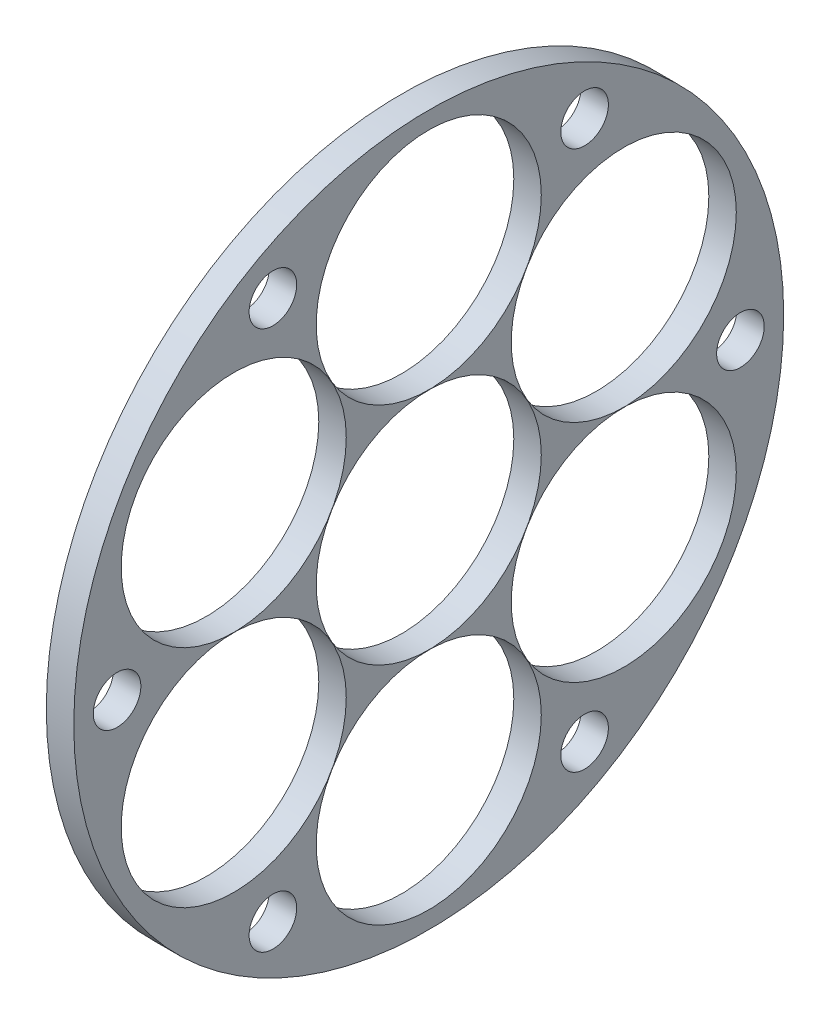
ISO-10303-21;
HEADER;
FILE_DESCRIPTION(('STEP AP214'),'2;1');
FILE_NAME('part.step','',(''),(''),'','','');
FILE_SCHEMA(('AUTOMOTIVE_DESIGN { 1 0 10303 214 1 1 1 1 }'));
ENDSEC;
DATA;
#1=APPLICATION_CONTEXT('core data for automotive mechanical design processes');
#2=APPLICATION_PROTOCOL_DEFINITION('international standard','automotive_design',2000,#1);
#3=PRODUCT_CONTEXT('',#1,'mechanical');
#4=PRODUCT('Part','Part','',(#3));
#5=PRODUCT_RELATED_PRODUCT_CATEGORY('part','',(#4));
#6=PRODUCT_DEFINITION_FORMATION('','',#4);
#7=PRODUCT_DEFINITION_CONTEXT('part definition',#1,'design');
#8=PRODUCT_DEFINITION('design','',#6,#7);
#9=PRODUCT_DEFINITION_SHAPE('','',#8);
#10=(LENGTH_UNIT() NAMED_UNIT(*) SI_UNIT(.MILLI.,.METRE.));
#11=(NAMED_UNIT(*) PLANE_ANGLE_UNIT() SI_UNIT($,.RADIAN.));
#12=(NAMED_UNIT(*) SI_UNIT($,.STERADIAN.) SOLID_ANGLE_UNIT());
#13=UNCERTAINTY_MEASURE_WITH_UNIT(LENGTH_MEASURE(1.E-05),#10,'distance_accuracy_value','');
#14=(GEOMETRIC_REPRESENTATION_CONTEXT(3) GLOBAL_UNCERTAINTY_ASSIGNED_CONTEXT((#13)) GLOBAL_UNIT_ASSIGNED_CONTEXT((#10,
#11,#12)) REPRESENTATION_CONTEXT('',''));
#15=CARTESIAN_POINT('',(0.,0.,0.));
#16=DIRECTION('',(0.,0.,1.));
#17=DIRECTION('',(1.,0.,0.));
#18=AXIS2_PLACEMENT_3D('',#15,#16,#17);
#19=CARTESIAN_POINT('',(3.175,0.,0.));
#20=DIRECTION('',(-1.,0.,0.));
#21=DIRECTION('',(0.,0.,1.));
#22=AXIS2_PLACEMENT_3D('',#19,#20,#21);
#23=CYLINDRICAL_SURFACE('',#22,41.);
#24=CARTESIAN_POINT('',(3.175,0.,0.));
#25=DIRECTION('',(1.,0.,0.));
#26=DIRECTION('',(0.,0.,-1.));
#27=AXIS2_PLACEMENT_3D('',#24,#25,#26);
#28=CIRCLE('',#27,41.);
#29=CARTESIAN_POINT('',(3.175,0.,-41.));
#30=VERTEX_POINT('',#29);
#31=EDGE_CURVE('E10',#30,#30,#28,.T.);
#32=ORIENTED_EDGE('',*,*,#31,.F.);
#33=EDGE_LOOP('',(#32));
#34=FACE_BOUND('',#33,.T.);
#35=CARTESIAN_POINT('',(0.,0.,0.));
#36=DIRECTION('',(1.,0.,0.));
#37=DIRECTION('',(0.,0.,-1.));
#38=AXIS2_PLACEMENT_3D('',#35,#36,#37);
#39=CIRCLE('',#38,41.);
#40=CARTESIAN_POINT('',(0.,0.,-41.));
#41=VERTEX_POINT('',#40);
#42=EDGE_CURVE('E38',#41,#41,#39,.T.);
#43=ORIENTED_EDGE('',*,*,#42,.T.);
#44=EDGE_LOOP('',(#43));
#45=FACE_BOUND('',#44,.T.);
#46=ADVANCED_FACE('F31',(#34,#45),#23,.T.);
#47=CARTESIAN_POINT('',(3.175,0.,0.));
#48=DIRECTION('',(1.,0.,0.));
#49=DIRECTION('',(0.,0.,-1.));
#50=AXIS2_PLACEMENT_3D('',#47,#48,#49);
#51=PLANE('',#50);
#52=CARTESIAN_POINT('',(3.175,-9.55835507043893E-13,35.999999999998));
#53=DIRECTION('',(1.,0.,0.));
#54=DIRECTION('',(0.,0.,-1.));
#55=AXIS2_PLACEMENT_3D('',#52,#53,#54);
#56=CIRCLE('',#55,2.74999999999999);
#57=CARTESIAN_POINT('',(3.175,-9.55835507043893E-13,33.249999999998));
#58=VERTEX_POINT('',#57);
#59=EDGE_CURVE('E102',#58,#58,#56,.T.);
#60=ORIENTED_EDGE('',*,*,#59,.F.);
#61=EDGE_LOOP('',(#60));
#62=FACE_BOUND('',#61,.T.);
#63=CARTESIAN_POINT('',(3.175,-31.1769145362397,17.9999999999962));
#64=DIRECTION('',(1.,0.,0.));
#65=DIRECTION('',(0.,0.,-1.));
#66=AXIS2_PLACEMENT_3D('',#63,#64,#65);
#67=CIRCLE('',#66,2.75);
#68=CARTESIAN_POINT('',(3.175,-31.1769145362397,15.2499999999963));
#69=VERTEX_POINT('',#68);
#70=EDGE_CURVE('E92',#69,#69,#67,.T.);
#71=ORIENTED_EDGE('',*,*,#70,.F.);
#72=EDGE_LOOP('',(#71));
#73=FACE_BOUND('',#72,.T.);
#74=CARTESIAN_POINT('',(3.175,-31.1769145362376,-18.0000000000037));
#75=DIRECTION('',(1.,0.,0.));
#76=DIRECTION('',(0.,0.,-1.));
#77=AXIS2_PLACEMENT_3D('',#74,#75,#76);
#78=CIRCLE('',#77,2.75);
#79=CARTESIAN_POINT('',(3.175,-31.1769145362376,-20.7500000000037));
#80=VERTEX_POINT('',#79);
#81=EDGE_CURVE('E89',#80,#80,#78,.T.);
#82=ORIENTED_EDGE('',*,*,#81,.F.);
#83=EDGE_LOOP('',(#82));
#84=FACE_BOUND('',#83,.T.);
#85=CARTESIAN_POINT('',(3.175,3.18322045019811E-12,-36.000000000002));
#86=DIRECTION('',(1.,0.,0.));
#87=DIRECTION('',(0.,0.,-1.));
#88=AXIS2_PLACEMENT_3D('',#85,#86,#87);
#89=CIRCLE('',#88,2.75);
#90=CARTESIAN_POINT('',(3.175,3.18322045019811E-12,-38.750000000002));
#91=VERTEX_POINT('',#90);
#92=EDGE_CURVE('E86',#91,#91,#89,.T.);
#93=ORIENTED_EDGE('',*,*,#92,.F.);
#94=EDGE_LOOP('',(#93));
#95=FACE_BOUND('',#94,.T.);
#96=CARTESIAN_POINT('',(3.175,31.1769145362419,-18.0000000000002));
#97=DIRECTION('',(1.,0.,0.));
#98=DIRECTION('',(0.,0.,-1.));
#99=AXIS2_PLACEMENT_3D('',#96,#97,#98);
#100=CIRCLE('',#99,2.75);
#101=CARTESIAN_POINT('',(3.175,31.1769145362419,-20.7500000000002));
#102=VERTEX_POINT('',#101);
#103=EDGE_CURVE('E82',#102,#102,#100,.T.);
#104=ORIENTED_EDGE('',*,*,#103,.F.);
#105=EDGE_LOOP('',(#104));
#106=FACE_BOUND('',#105,.T.);
#107=CARTESIAN_POINT('',(3.175,13.0049999999981,22.5253207524322));
#108=DIRECTION('',(1.,0.,0.));
#109=DIRECTION('',(0.,0.,-1.));
#110=AXIS2_PLACEMENT_3D('',#107,#108,#109);
#111=CIRCLE('',#110,13.);
#112=CARTESIAN_POINT('',(3.175,13.0049999999981,9.52532075243216));
#113=VERTEX_POINT('',#112);
#114=EDGE_CURVE('E78',#113,#113,#111,.T.);
#115=ORIENTED_EDGE('',*,*,#114,.F.);
#116=EDGE_LOOP('',(#115));
#117=FACE_BOUND('',#116,.T.);
#118=CARTESIAN_POINT('',(3.175,-13.0050000000019,22.52532075243));
#119=DIRECTION('',(1.,0.,0.));
#120=DIRECTION('',(0.,0.,-1.));
#121=AXIS2_PLACEMENT_3D('',#118,#119,#120);
#122=CIRCLE('',#121,13.);
#123=CARTESIAN_POINT('',(3.175,-13.0050000000019,9.52532075242995));
#124=VERTEX_POINT('',#123);
#125=EDGE_CURVE('E74',#124,#124,#122,.T.);
#126=ORIENTED_EDGE('',*,*,#125,.F.);
#127=EDGE_LOOP('',(#126));
#128=FACE_BOUND('',#127,.T.);
#129=CARTESIAN_POINT('',(3.175,-26.01,-4.39178710117822E-12));
#130=DIRECTION('',(1.,0.,0.));
#131=DIRECTION('',(0.,0.,-1.));
#132=AXIS2_PLACEMENT_3D('',#129,#130,#131);
#133=CIRCLE('',#132,13.);
#134=CARTESIAN_POINT('',(3.175,-26.01,-13.0000000000044));
#135=VERTEX_POINT('',#134);
#136=EDGE_CURVE('E70',#135,#135,#133,.T.);
#137=ORIENTED_EDGE('',*,*,#136,.F.);
#138=EDGE_LOOP('',(#137));
#139=FACE_BOUND('',#138,.T.);
#140=CARTESIAN_POINT('',(3.175,-13.0049999999981,-22.5253207524365));
#141=DIRECTION('',(1.,0.,0.));
#142=DIRECTION('',(0.,0.,-1.));
#143=AXIS2_PLACEMENT_3D('',#140,#141,#142);
#144=CIRCLE('',#143,13.);
#145=CARTESIAN_POINT('',(3.175,-13.0049999999981,-35.5253207524365));
#146=VERTEX_POINT('',#145);
#147=EDGE_CURVE('E66',#146,#146,#144,.T.);
#148=ORIENTED_EDGE('',*,*,#147,.F.);
#149=EDGE_LOOP('',(#148));
#150=FACE_BOUND('',#149,.T.);
#151=CARTESIAN_POINT('',(3.175,13.0050000000019,-22.5253207524343));
#152=DIRECTION('',(1.,0.,0.));
#153=DIRECTION('',(0.,0.,-1.));
#154=AXIS2_PLACEMENT_3D('',#151,#152,#153);
#155=CIRCLE('',#154,13.);
#156=CARTESIAN_POINT('',(3.175,13.0050000000019,-35.5253207524343));
#157=VERTEX_POINT('',#156);
#158=EDGE_CURVE('E62',#157,#157,#155,.T.);
#159=ORIENTED_EDGE('',*,*,#158,.F.);
#160=EDGE_LOOP('',(#159));
#161=FACE_BOUND('',#160,.T.);
#162=CARTESIAN_POINT('',(3.175,31.1769145362399,17.9999999999998));
#163=DIRECTION('',(1.,0.,0.));
#164=DIRECTION('',(0.,0.,-1.));
#165=AXIS2_PLACEMENT_3D('',#162,#163,#164);
#166=CIRCLE('',#165,2.75);
#167=CARTESIAN_POINT('',(3.175,31.1769145362399,15.2499999999998));
#168=VERTEX_POINT('',#167);
#169=EDGE_CURVE('E58',#168,#168,#166,.T.);
#170=ORIENTED_EDGE('',*,*,#169,.F.);
#171=EDGE_LOOP('',(#170));
#172=FACE_BOUND('',#171,.T.);
#173=CARTESIAN_POINT('',(3.175,26.01,0.));
#174=DIRECTION('',(1.,0.,0.));
#175=DIRECTION('',(0.,0.,-1.));
#176=AXIS2_PLACEMENT_3D('',#173,#174,#175);
#177=CIRCLE('',#176,13.);
#178=CARTESIAN_POINT('',(3.175,26.01,-13.));
#179=VERTEX_POINT('',#178);
#180=EDGE_CURVE('E54',#179,#179,#177,.T.);
#181=ORIENTED_EDGE('',*,*,#180,.F.);
#182=EDGE_LOOP('',(#181));
#183=FACE_BOUND('',#182,.T.);
#184=CARTESIAN_POINT('',(3.175,0.,0.));
#185=DIRECTION('',(1.,0.,0.));
#186=DIRECTION('',(0.,0.,-1.));
#187=AXIS2_PLACEMENT_3D('',#184,#185,#186);
#188=CIRCLE('',#187,13.);
#189=CARTESIAN_POINT('',(3.175,0.,-13.));
#190=VERTEX_POINT('',#189);
#191=EDGE_CURVE('E46',#190,#190,#188,.T.);
#192=ORIENTED_EDGE('',*,*,#191,.F.);
#193=EDGE_LOOP('',(#192));
#194=FACE_BOUND('',#193,.T.);
#195=ORIENTED_EDGE('',*,*,#31,.T.);
#196=EDGE_LOOP('',(#195));
#197=FACE_BOUND('',#196,.T.);
#198=ADVANCED_FACE('F126',(#62,#73,#84,#95,#106,#117,#128,#139,#150,#161,#172,#183,#194,#197),
#51,.T.);
#199=CARTESIAN_POINT('',(0.,0.,0.));
#200=DIRECTION('',(1.,0.,0.));
#201=DIRECTION('',(0.,0.,-1.));
#202=AXIS2_PLACEMENT_3D('',#199,#200,#201);
#203=PLANE('',#202);
#204=CARTESIAN_POINT('',(0.,-9.55835507043893E-13,35.999999999998));
#205=DIRECTION('',(1.,0.,0.));
#206=DIRECTION('',(0.,0.,-1.));
#207=AXIS2_PLACEMENT_3D('',#204,#205,#206);
#208=CIRCLE('',#207,2.74999999999999);
#209=CARTESIAN_POINT('',(0.,-9.55835507043893E-13,33.249999999998));
#210=VERTEX_POINT('',#209);
#211=EDGE_CURVE('E34',#210,#210,#208,.T.);
#212=ORIENTED_EDGE('',*,*,#211,.T.);
#213=EDGE_LOOP('',(#212));
#214=FACE_BOUND('',#213,.T.);
#215=CARTESIAN_POINT('',(0.,-31.1769145362397,17.9999999999962));
#216=DIRECTION('',(1.,0.,0.));
#217=DIRECTION('',(0.,0.,-1.));
#218=AXIS2_PLACEMENT_3D('',#215,#216,#217);
#219=CIRCLE('',#218,2.75);
#220=CARTESIAN_POINT('',(0.,-31.1769145362397,15.2499999999963));
#221=VERTEX_POINT('',#220);
#222=EDGE_CURVE('E90',#221,#221,#219,.T.);
#223=ORIENTED_EDGE('',*,*,#222,.T.);
#224=EDGE_LOOP('',(#223));
#225=FACE_BOUND('',#224,.T.);
#226=CARTESIAN_POINT('',(0.,-31.1769145362376,-18.0000000000037));
#227=DIRECTION('',(1.,0.,0.));
#228=DIRECTION('',(0.,0.,-1.));
#229=AXIS2_PLACEMENT_3D('',#226,#227,#228);
#230=CIRCLE('',#229,2.75);
#231=CARTESIAN_POINT('',(0.,-31.1769145362376,-20.7500000000037));
#232=VERTEX_POINT('',#231);
#233=EDGE_CURVE('E87',#232,#232,#230,.T.);
#234=ORIENTED_EDGE('',*,*,#233,.T.);
#235=EDGE_LOOP('',(#234));
#236=FACE_BOUND('',#235,.T.);
#237=CARTESIAN_POINT('',(0.,3.18322045019811E-12,-36.000000000002));
#238=DIRECTION('',(1.,0.,0.));
#239=DIRECTION('',(0.,0.,-1.));
#240=AXIS2_PLACEMENT_3D('',#237,#238,#239);
#241=CIRCLE('',#240,2.75);
#242=CARTESIAN_POINT('',(0.,3.18322045019811E-12,-38.750000000002));
#243=VERTEX_POINT('',#242);
#244=EDGE_CURVE('E83',#243,#243,#241,.T.);
#245=ORIENTED_EDGE('',*,*,#244,.T.);
#246=EDGE_LOOP('',(#245));
#247=FACE_BOUND('',#246,.T.);
#248=CARTESIAN_POINT('',(0.,31.1769145362419,-18.0000000000002));
#249=DIRECTION('',(1.,0.,0.));
#250=DIRECTION('',(0.,0.,-1.));
#251=AXIS2_PLACEMENT_3D('',#248,#249,#250);
#252=CIRCLE('',#251,2.75);
#253=CARTESIAN_POINT('',(0.,31.1769145362419,-20.7500000000002));
#254=VERTEX_POINT('',#253);
#255=EDGE_CURVE('E79',#254,#254,#252,.T.);
#256=ORIENTED_EDGE('',*,*,#255,.T.);
#257=EDGE_LOOP('',(#256));
#258=FACE_BOUND('',#257,.T.);
#259=CARTESIAN_POINT('',(0.,13.0049999999981,22.5253207524322));
#260=DIRECTION('',(1.,0.,0.));
#261=DIRECTION('',(0.,0.,-1.));
#262=AXIS2_PLACEMENT_3D('',#259,#260,#261);
#263=CIRCLE('',#262,13.);
#264=CARTESIAN_POINT('',(0.,13.0049999999981,9.52532075243216));
#265=VERTEX_POINT('',#264);
#266=EDGE_CURVE('E75',#265,#265,#263,.T.);
#267=ORIENTED_EDGE('',*,*,#266,.T.);
#268=EDGE_LOOP('',(#267));
#269=FACE_BOUND('',#268,.T.);
#270=CARTESIAN_POINT('',(0.,-13.0050000000019,22.52532075243));
#271=DIRECTION('',(1.,0.,0.));
#272=DIRECTION('',(0.,0.,-1.));
#273=AXIS2_PLACEMENT_3D('',#270,#271,#272);
#274=CIRCLE('',#273,13.);
#275=CARTESIAN_POINT('',(0.,-13.0050000000019,9.52532075242995));
#276=VERTEX_POINT('',#275);
#277=EDGE_CURVE('E71',#276,#276,#274,.T.);
#278=ORIENTED_EDGE('',*,*,#277,.T.);
#279=EDGE_LOOP('',(#278));
#280=FACE_BOUND('',#279,.T.);
#281=CARTESIAN_POINT('',(0.,-26.01,-4.39178710117822E-12));
#282=DIRECTION('',(1.,0.,0.));
#283=DIRECTION('',(0.,0.,-1.));
#284=AXIS2_PLACEMENT_3D('',#281,#282,#283);
#285=CIRCLE('',#284,13.);
#286=CARTESIAN_POINT('',(0.,-26.01,-13.0000000000044));
#287=VERTEX_POINT('',#286);
#288=EDGE_CURVE('E67',#287,#287,#285,.T.);
#289=ORIENTED_EDGE('',*,*,#288,.T.);
#290=EDGE_LOOP('',(#289));
#291=FACE_BOUND('',#290,.T.);
#292=CARTESIAN_POINT('',(0.,-13.0049999999981,-22.5253207524365));
#293=DIRECTION('',(1.,0.,0.));
#294=DIRECTION('',(0.,0.,-1.));
#295=AXIS2_PLACEMENT_3D('',#292,#293,#294);
#296=CIRCLE('',#295,13.);
#297=CARTESIAN_POINT('',(0.,-13.0049999999981,-35.5253207524365));
#298=VERTEX_POINT('',#297);
#299=EDGE_CURVE('E63',#298,#298,#296,.T.);
#300=ORIENTED_EDGE('',*,*,#299,.T.);
#301=EDGE_LOOP('',(#300));
#302=FACE_BOUND('',#301,.T.);
#303=CARTESIAN_POINT('',(0.,13.0050000000019,-22.5253207524343));
#304=DIRECTION('',(1.,0.,0.));
#305=DIRECTION('',(0.,0.,-1.));
#306=AXIS2_PLACEMENT_3D('',#303,#304,#305);
#307=CIRCLE('',#306,13.);
#308=CARTESIAN_POINT('',(0.,13.0050000000019,-35.5253207524343));
#309=VERTEX_POINT('',#308);
#310=EDGE_CURVE('E59',#309,#309,#307,.T.);
#311=ORIENTED_EDGE('',*,*,#310,.T.);
#312=EDGE_LOOP('',(#311));
#313=FACE_BOUND('',#312,.T.);
#314=CARTESIAN_POINT('',(0.,31.1769145362399,17.9999999999998));
#315=DIRECTION('',(1.,0.,0.));
#316=DIRECTION('',(0.,0.,-1.));
#317=AXIS2_PLACEMENT_3D('',#314,#315,#316);
#318=CIRCLE('',#317,2.75);
#319=CARTESIAN_POINT('',(0.,31.1769145362399,15.2499999999998));
#320=VERTEX_POINT('',#319);
#321=EDGE_CURVE('E55',#320,#320,#318,.T.);
#322=ORIENTED_EDGE('',*,*,#321,.T.);
#323=EDGE_LOOP('',(#322));
#324=FACE_BOUND('',#323,.T.);
#325=CARTESIAN_POINT('',(0.,26.01,0.));
#326=DIRECTION('',(1.,0.,0.));
#327=DIRECTION('',(0.,0.,-1.));
#328=AXIS2_PLACEMENT_3D('',#325,#326,#327);
#329=CIRCLE('',#328,13.);
#330=CARTESIAN_POINT('',(0.,26.01,-13.));
#331=VERTEX_POINT('',#330);
#332=EDGE_CURVE('E51',#331,#331,#329,.T.);
#333=ORIENTED_EDGE('',*,*,#332,.T.);
#334=EDGE_LOOP('',(#333));
#335=FACE_BOUND('',#334,.T.);
#336=CARTESIAN_POINT('',(0.,0.,0.));
#337=DIRECTION('',(1.,0.,0.));
#338=DIRECTION('',(0.,0.,-1.));
#339=AXIS2_PLACEMENT_3D('',#336,#337,#338);
#340=CIRCLE('',#339,13.);
#341=CARTESIAN_POINT('',(0.,0.,-13.));
#342=VERTEX_POINT('',#341);
#343=EDGE_CURVE('E43',#342,#342,#340,.T.);
#344=ORIENTED_EDGE('',*,*,#343,.T.);
#345=EDGE_LOOP('',(#344));
#346=FACE_BOUND('',#345,.T.);
#347=ORIENTED_EDGE('',*,*,#42,.F.);
#348=EDGE_LOOP('',(#347));
#349=FACE_BOUND('',#348,.T.);
#350=ADVANCED_FACE('F129',(#214,#225,#236,#247,#258,#269,#280,#291,#302,#313,#324,#335,#346,
#349),#203,.F.);
#351=CARTESIAN_POINT('',(-21.825,0.,0.));
#352=DIRECTION('',(1.,0.,0.));
#353=DIRECTION('',(0.,0.,-1.));
#354=AXIS2_PLACEMENT_3D('',#351,#352,#353);
#355=CYLINDRICAL_SURFACE('',#354,13.);
#356=ORIENTED_EDGE('',*,*,#191,.T.);
#357=EDGE_LOOP('',(#356));
#358=FACE_BOUND('',#357,.T.);
#359=ORIENTED_EDGE('',*,*,#343,.F.);
#360=EDGE_LOOP('',(#359));
#361=FACE_BOUND('',#360,.T.);
#362=ADVANCED_FACE('F135',(#358,#361),#355,.F.);
#363=CARTESIAN_POINT('',(-21.825,26.01,0.));
#364=DIRECTION('',(1.,0.,0.));
#365=DIRECTION('',(0.,0.,-1.));
#366=AXIS2_PLACEMENT_3D('',#363,#364,#365);
#367=CYLINDRICAL_SURFACE('',#366,13.);
#368=ORIENTED_EDGE('',*,*,#180,.T.);
#369=EDGE_LOOP('',(#368));
#370=FACE_BOUND('',#369,.T.);
#371=ORIENTED_EDGE('',*,*,#332,.F.);
#372=EDGE_LOOP('',(#371));
#373=FACE_BOUND('',#372,.T.);
#374=ADVANCED_FACE('F123',(#370,#373),#367,.F.);
#375=CARTESIAN_POINT('',(-21.825,31.1769145362399,17.9999999999998));
#376=DIRECTION('',(1.,0.,0.));
#377=DIRECTION('',(0.,0.,-1.));
#378=AXIS2_PLACEMENT_3D('',#375,#376,#377);
#379=CYLINDRICAL_SURFACE('',#378,2.75);
#380=ORIENTED_EDGE('',*,*,#169,.T.);
#381=EDGE_LOOP('',(#380));
#382=FACE_BOUND('',#381,.T.);
#383=ORIENTED_EDGE('',*,*,#321,.F.);
#384=EDGE_LOOP('',(#383));
#385=FACE_BOUND('',#384,.T.);
#386=ADVANCED_FACE('F168',(#382,#385),#379,.F.);
#387=CARTESIAN_POINT('',(-21.825,13.0050000000019,-22.5253207524343));
#388=DIRECTION('',(1.,0.,0.));
#389=DIRECTION('',(0.,0.,-1.));
#390=AXIS2_PLACEMENT_3D('',#387,#388,#389);
#391=CYLINDRICAL_SURFACE('',#390,13.);
#392=ORIENTED_EDGE('',*,*,#158,.T.);
#393=EDGE_LOOP('',(#392));
#394=FACE_BOUND('',#393,.T.);
#395=ORIENTED_EDGE('',*,*,#310,.F.);
#396=EDGE_LOOP('',(#395));
#397=FACE_BOUND('',#396,.T.);
#398=ADVANCED_FACE('F175',(#394,#397),#391,.F.);
#399=CARTESIAN_POINT('',(-21.825,-13.0049999999981,-22.5253207524365));
#400=DIRECTION('',(1.,0.,0.));
#401=DIRECTION('',(0.,0.,-1.));
#402=AXIS2_PLACEMENT_3D('',#399,#400,#401);
#403=CYLINDRICAL_SURFACE('',#402,13.);
#404=ORIENTED_EDGE('',*,*,#147,.T.);
#405=EDGE_LOOP('',(#404));
#406=FACE_BOUND('',#405,.T.);
#407=ORIENTED_EDGE('',*,*,#299,.F.);
#408=EDGE_LOOP('',(#407));
#409=FACE_BOUND('',#408,.T.);
#410=ADVANCED_FACE('F183',(#406,#409),#403,.F.);
#411=CARTESIAN_POINT('',(-21.825,-26.01,-4.39178710117822E-12));
#412=DIRECTION('',(1.,0.,0.));
#413=DIRECTION('',(0.,0.,-1.));
#414=AXIS2_PLACEMENT_3D('',#411,#412,#413);
#415=CYLINDRICAL_SURFACE('',#414,13.);
#416=ORIENTED_EDGE('',*,*,#136,.T.);
#417=EDGE_LOOP('',(#416));
#418=FACE_BOUND('',#417,.T.);
#419=ORIENTED_EDGE('',*,*,#288,.F.);
#420=EDGE_LOOP('',(#419));
#421=FACE_BOUND('',#420,.T.);
#422=ADVANCED_FACE('F191',(#418,#421),#415,.F.);
#423=CARTESIAN_POINT('',(-21.825,-13.0050000000019,22.52532075243));
#424=DIRECTION('',(1.,0.,0.));
#425=DIRECTION('',(0.,0.,-1.));
#426=AXIS2_PLACEMENT_3D('',#423,#424,#425);
#427=CYLINDRICAL_SURFACE('',#426,13.);
#428=ORIENTED_EDGE('',*,*,#125,.T.);
#429=EDGE_LOOP('',(#428));
#430=FACE_BOUND('',#429,.T.);
#431=ORIENTED_EDGE('',*,*,#277,.F.);
#432=EDGE_LOOP('',(#431));
#433=FACE_BOUND('',#432,.T.);
#434=ADVANCED_FACE('F199',(#430,#433),#427,.F.);
#435=CARTESIAN_POINT('',(-21.825,13.0049999999981,22.5253207524322));
#436=DIRECTION('',(1.,0.,0.));
#437=DIRECTION('',(0.,0.,-1.));
#438=AXIS2_PLACEMENT_3D('',#435,#436,#437);
#439=CYLINDRICAL_SURFACE('',#438,13.);
#440=ORIENTED_EDGE('',*,*,#114,.T.);
#441=EDGE_LOOP('',(#440));
#442=FACE_BOUND('',#441,.T.);
#443=ORIENTED_EDGE('',*,*,#266,.F.);
#444=EDGE_LOOP('',(#443));
#445=FACE_BOUND('',#444,.T.);
#446=ADVANCED_FACE('F207',(#442,#445),#439,.F.);
#447=CARTESIAN_POINT('',(-21.825,31.1769145362419,-18.0000000000002));
#448=DIRECTION('',(1.,0.,0.));
#449=DIRECTION('',(0.,0.,-1.));
#450=AXIS2_PLACEMENT_3D('',#447,#448,#449);
#451=CYLINDRICAL_SURFACE('',#450,2.75);
#452=ORIENTED_EDGE('',*,*,#103,.T.);
#453=EDGE_LOOP('',(#452));
#454=FACE_BOUND('',#453,.T.);
#455=ORIENTED_EDGE('',*,*,#255,.F.);
#456=EDGE_LOOP('',(#455));
#457=FACE_BOUND('',#456,.T.);
#458=ADVANCED_FACE('F215',(#454,#457),#451,.F.);
#459=CARTESIAN_POINT('',(-21.825,3.18322045019811E-12,-36.000000000002));
#460=DIRECTION('',(1.,0.,0.));
#461=DIRECTION('',(0.,0.,-1.));
#462=AXIS2_PLACEMENT_3D('',#459,#460,#461);
#463=CYLINDRICAL_SURFACE('',#462,2.75);
#464=ORIENTED_EDGE('',*,*,#92,.T.);
#465=EDGE_LOOP('',(#464));
#466=FACE_BOUND('',#465,.T.);
#467=ORIENTED_EDGE('',*,*,#244,.F.);
#468=EDGE_LOOP('',(#467));
#469=FACE_BOUND('',#468,.T.);
#470=ADVANCED_FACE('F223',(#466,#469),#463,.F.);
#471=CARTESIAN_POINT('',(-21.825,-31.1769145362376,-18.0000000000037));
#472=DIRECTION('',(1.,0.,0.));
#473=DIRECTION('',(0.,0.,-1.));
#474=AXIS2_PLACEMENT_3D('',#471,#472,#473);
#475=CYLINDRICAL_SURFACE('',#474,2.75);
#476=ORIENTED_EDGE('',*,*,#81,.T.);
#477=EDGE_LOOP('',(#476));
#478=FACE_BOUND('',#477,.T.);
#479=ORIENTED_EDGE('',*,*,#233,.F.);
#480=EDGE_LOOP('',(#479));
#481=FACE_BOUND('',#480,.T.);
#482=ADVANCED_FACE('F231',(#478,#481),#475,.F.);
#483=CARTESIAN_POINT('',(-21.825,-31.1769145362397,17.9999999999962));
#484=DIRECTION('',(1.,0.,0.));
#485=DIRECTION('',(0.,0.,-1.));
#486=AXIS2_PLACEMENT_3D('',#483,#484,#485);
#487=CYLINDRICAL_SURFACE('',#486,2.75);
#488=ORIENTED_EDGE('',*,*,#70,.T.);
#489=EDGE_LOOP('',(#488));
#490=FACE_BOUND('',#489,.T.);
#491=ORIENTED_EDGE('',*,*,#222,.F.);
#492=EDGE_LOOP('',(#491));
#493=FACE_BOUND('',#492,.T.);
#494=ADVANCED_FACE('F239',(#490,#493),#487,.F.);
#495=CARTESIAN_POINT('',(-21.825,-9.55835507043893E-13,35.999999999998));
#496=DIRECTION('',(1.,0.,0.));
#497=DIRECTION('',(0.,0.,-1.));
#498=AXIS2_PLACEMENT_3D('',#495,#496,#497);
#499=CYLINDRICAL_SURFACE('',#498,2.74999999999999);
#500=ORIENTED_EDGE('',*,*,#59,.T.);
#501=EDGE_LOOP('',(#500));
#502=FACE_BOUND('',#501,.T.);
#503=ORIENTED_EDGE('',*,*,#211,.F.);
#504=EDGE_LOOP('',(#503));
#505=FACE_BOUND('',#504,.T.);
#506=ADVANCED_FACE('F247',(#502,#505),#499,.F.);
#507=CLOSED_SHELL('',(#46,#198,#350,#362,#374,#386,#398,#410,#422,#434,#446,#458,#470,#482,#494,#506));
#508=MANIFOLD_SOLID_BREP('B2',#507);
#509=ADVANCED_BREP_SHAPE_REPRESENTATION('',(#18,#508),#14);
#510=SHAPE_DEFINITION_REPRESENTATION(#9,#509);
ENDSEC;
END-ISO-10303-21;
